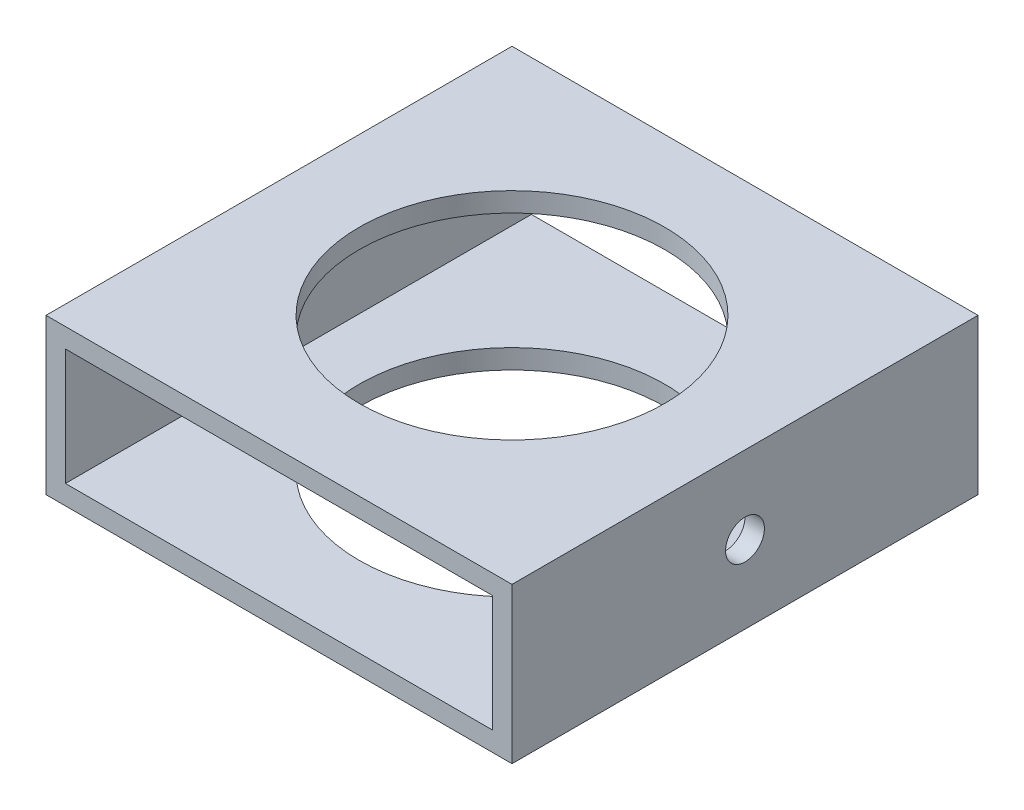
ISO-10303-21;
HEADER;
FILE_DESCRIPTION(('STEP AP214'),'2;1');
FILE_NAME('part.step','',(''),(''),'','','');
FILE_SCHEMA(('AUTOMOTIVE_DESIGN { 1 0 10303 214 1 1 1 1 }'));
ENDSEC;
DATA;
#1=APPLICATION_CONTEXT('core data for automotive mechanical design processes');
#2=APPLICATION_PROTOCOL_DEFINITION('international standard','automotive_design',2000,#1);
#3=PRODUCT_CONTEXT('',#1,'mechanical');
#4=PRODUCT('Part','Part','',(#3));
#5=PRODUCT_RELATED_PRODUCT_CATEGORY('part','',(#4));
#6=PRODUCT_DEFINITION_FORMATION('','',#4);
#7=PRODUCT_DEFINITION_CONTEXT('part definition',#1,'design');
#8=PRODUCT_DEFINITION('design','',#6,#7);
#9=PRODUCT_DEFINITION_SHAPE('','',#8);
#10=(LENGTH_UNIT() NAMED_UNIT(*) SI_UNIT(.MILLI.,.METRE.));
#11=(NAMED_UNIT(*) PLANE_ANGLE_UNIT() SI_UNIT($,.RADIAN.));
#12=(NAMED_UNIT(*) SI_UNIT($,.STERADIAN.) SOLID_ANGLE_UNIT());
#13=UNCERTAINTY_MEASURE_WITH_UNIT(LENGTH_MEASURE(1.E-05),#10,'distance_accuracy_value','');
#14=(GEOMETRIC_REPRESENTATION_CONTEXT(3) GLOBAL_UNCERTAINTY_ASSIGNED_CONTEXT((#13)) GLOBAL_UNIT_ASSIGNED_CONTEXT((#10,
#11,#12)) REPRESENTATION_CONTEXT('',''));
#15=CARTESIAN_POINT('',(0.,0.,0.));
#16=DIRECTION('',(0.,0.,1.));
#17=DIRECTION('',(1.,0.,0.));
#18=AXIS2_PLACEMENT_3D('',#15,#16,#17);
#19=CARTESIAN_POINT('',(0.,0.,38.1));
#20=DIRECTION('',(0.,0.,1.));
#21=DIRECTION('',(1.,0.,0.));
#22=AXIS2_PLACEMENT_3D('',#19,#20,#21);
#23=PLANE('',#22);
#24=DIRECTION('',(0.,1.,0.));
#25=VECTOR('',#24,1.);
#26=CARTESIAN_POINT('',(38.1,-12.7,38.1));
#27=LINE('',#26,#25);
#28=CARTESIAN_POINT('',(38.1,-12.7,38.1));
#29=VERTEX_POINT('',#28);
#30=CARTESIAN_POINT('',(38.1,12.7,38.1));
#31=VERTEX_POINT('',#30);
#32=EDGE_CURVE('E179',#29,#31,#27,.T.);
#33=ORIENTED_EDGE('',*,*,#32,.T.);
#34=DIRECTION('',(-1.,0.,0.));
#35=VECTOR('',#34,1.);
#36=CARTESIAN_POINT('',(-38.1,12.7,38.1));
#37=LINE('',#36,#35);
#38=CARTESIAN_POINT('',(-38.1,12.7,38.1));
#39=VERTEX_POINT('',#38);
#40=EDGE_CURVE('E183',#31,#39,#37,.T.);
#41=ORIENTED_EDGE('',*,*,#40,.T.);
#42=DIRECTION('',(0.,-1.,0.));
#43=VECTOR('',#42,1.);
#44=CARTESIAN_POINT('',(-38.1,-12.7,38.1));
#45=LINE('',#44,#43);
#46=CARTESIAN_POINT('',(-38.1,-12.7,38.1));
#47=VERTEX_POINT('',#46);
#48=EDGE_CURVE('E187',#39,#47,#45,.T.);
#49=ORIENTED_EDGE('',*,*,#48,.T.);
#50=DIRECTION('',(1.,0.,0.));
#51=VECTOR('',#50,1.);
#52=CARTESIAN_POINT('',(-38.1,-12.7,38.1));
#53=LINE('',#52,#51);
#54=EDGE_CURVE('E190',#47,#29,#53,.T.);
#55=ORIENTED_EDGE('',*,*,#54,.T.);
#56=EDGE_LOOP('',(#33,#41,#49,#55));
#57=FACE_BOUND('',#56,.T.);
#58=DIRECTION('',(-1.,0.,0.));
#59=VECTOR('',#58,1.);
#60=CARTESIAN_POINT('',(0.,9.525,38.1));
#61=LINE('',#60,#59);
#62=CARTESIAN_POINT('',(34.925,9.525,38.1));
#63=VERTEX_POINT('',#62);
#64=CARTESIAN_POINT('',(-34.925,9.525,38.1));
#65=VERTEX_POINT('',#64);
#66=EDGE_CURVE('E138',#63,#65,#61,.T.);
#67=ORIENTED_EDGE('',*,*,#66,.F.);
#68=DIRECTION('',(0.,1.,0.));
#69=VECTOR('',#68,1.);
#70=CARTESIAN_POINT('',(34.925,0.,38.1));
#71=LINE('',#70,#69);
#72=CARTESIAN_POINT('',(34.925,-9.525,38.1));
#73=VERTEX_POINT('',#72);
#74=EDGE_CURVE('E129',#73,#63,#71,.T.);
#75=ORIENTED_EDGE('',*,*,#74,.F.);
#76=DIRECTION('',(1.,0.,0.));
#77=VECTOR('',#76,1.);
#78=CARTESIAN_POINT('',(0.,-9.525,38.1));
#79=LINE('',#78,#77);
#80=CARTESIAN_POINT('',(-34.925,-9.525,38.1));
#81=VERTEX_POINT('',#80);
#82=EDGE_CURVE('E155',#81,#73,#79,.T.);
#83=ORIENTED_EDGE('',*,*,#82,.F.);
#84=DIRECTION('',(0.,-1.,0.));
#85=VECTOR('',#84,1.);
#86=CARTESIAN_POINT('',(-34.925,0.,38.1));
#87=LINE('',#86,#85);
#88=EDGE_CURVE('E151',#65,#81,#87,.T.);
#89=ORIENTED_EDGE('',*,*,#88,.F.);
#90=EDGE_LOOP('',(#67,#75,#83,#89));
#91=FACE_BOUND('',#90,.T.);
#92=ADVANCED_FACE('F61',(#57,#91),#23,.T.);
#93=CARTESIAN_POINT('',(0.,0.,-38.1));
#94=DIRECTION('',(0.,0.,1.));
#95=DIRECTION('',(1.,0.,0.));
#96=AXIS2_PLACEMENT_3D('',#93,#94,#95);
#97=PLANE('',#96);
#98=DIRECTION('',(0.,1.,0.));
#99=VECTOR('',#98,1.);
#100=CARTESIAN_POINT('',(38.1,-12.7,-38.1));
#101=LINE('',#100,#99);
#102=CARTESIAN_POINT('',(38.1,-12.7,-38.1));
#103=VERTEX_POINT('',#102);
#104=CARTESIAN_POINT('',(38.1,12.7,-38.1));
#105=VERTEX_POINT('',#104);
#106=EDGE_CURVE('E147',#103,#105,#101,.T.);
#107=ORIENTED_EDGE('',*,*,#106,.F.);
#108=DIRECTION('',(1.,0.,0.));
#109=VECTOR('',#108,1.);
#110=CARTESIAN_POINT('',(-38.1,-12.7,-38.1));
#111=LINE('',#110,#109);
#112=CARTESIAN_POINT('',(-38.1,-12.7,-38.1));
#113=VERTEX_POINT('',#112);
#114=EDGE_CURVE('E184',#113,#103,#111,.T.);
#115=ORIENTED_EDGE('',*,*,#114,.F.);
#116=DIRECTION('',(0.,-1.,0.));
#117=VECTOR('',#116,1.);
#118=CARTESIAN_POINT('',(-38.1,-12.7,-38.1));
#119=LINE('',#118,#117);
#120=CARTESIAN_POINT('',(-38.1,12.7,-38.1));
#121=VERTEX_POINT('',#120);
#122=EDGE_CURVE('E200',#121,#113,#119,.T.);
#123=ORIENTED_EDGE('',*,*,#122,.F.);
#124=DIRECTION('',(-1.,0.,0.));
#125=VECTOR('',#124,1.);
#126=CARTESIAN_POINT('',(-38.1,12.7,-38.1));
#127=LINE('',#126,#125);
#128=EDGE_CURVE('E197',#105,#121,#127,.T.);
#129=ORIENTED_EDGE('',*,*,#128,.F.);
#130=EDGE_LOOP('',(#107,#115,#123,#129));
#131=FACE_BOUND('',#130,.T.);
#132=DIRECTION('',(0.,1.,0.));
#133=VECTOR('',#132,1.);
#134=CARTESIAN_POINT('',(34.925,0.,-38.1));
#135=LINE('',#134,#133);
#136=CARTESIAN_POINT('',(34.925,-9.525,-38.1));
#137=VERTEX_POINT('',#136);
#138=CARTESIAN_POINT('',(34.925,9.525,-38.1));
#139=VERTEX_POINT('',#138);
#140=EDGE_CURVE('E87',#137,#139,#135,.T.);
#141=ORIENTED_EDGE('',*,*,#140,.T.);
#142=DIRECTION('',(-1.,0.,0.));
#143=VECTOR('',#142,1.);
#144=CARTESIAN_POINT('',(0.,9.525,-38.1));
#145=LINE('',#144,#143);
#146=CARTESIAN_POINT('',(-34.925,9.525,-38.1));
#147=VERTEX_POINT('',#146);
#148=EDGE_CURVE('E145',#139,#147,#145,.T.);
#149=ORIENTED_EDGE('',*,*,#148,.T.);
#150=DIRECTION('',(0.,-1.,0.));
#151=VECTOR('',#150,1.);
#152=CARTESIAN_POINT('',(-34.925,0.,-38.1));
#153=LINE('',#152,#151);
#154=CARTESIAN_POINT('',(-34.925,-9.525,-38.1));
#155=VERTEX_POINT('',#154);
#156=EDGE_CURVE('E166',#147,#155,#153,.T.);
#157=ORIENTED_EDGE('',*,*,#156,.T.);
#158=DIRECTION('',(1.,0.,0.));
#159=VECTOR('',#158,1.);
#160=CARTESIAN_POINT('',(0.,-9.525,-38.1));
#161=LINE('',#160,#159);
#162=EDGE_CURVE('E139',#155,#137,#161,.T.);
#163=ORIENTED_EDGE('',*,*,#162,.T.);
#164=EDGE_LOOP('',(#141,#149,#157,#163));
#165=FACE_BOUND('',#164,.T.);
#166=ADVANCED_FACE('F259',(#131,#165),#97,.F.);
#167=CARTESIAN_POINT('',(38.1,-12.7,38.1));
#168=DIRECTION('',(-1.,0.,0.));
#169=DIRECTION('',(0.,0.,1.));
#170=AXIS2_PLACEMENT_3D('',#167,#168,#169);
#171=PLANE('',#170);
#172=CARTESIAN_POINT('',(38.1,0.,0.));
#173=DIRECTION('',(-1.,0.,0.));
#174=DIRECTION('',(0.,0.,1.));
#175=AXIS2_PLACEMENT_3D('',#172,#173,#174);
#176=CIRCLE('',#175,3.175);
#177=CARTESIAN_POINT('',(38.1,0.,3.175));
#178=VERTEX_POINT('',#177);
#179=EDGE_CURVE('E217',#178,#178,#176,.T.);
#180=ORIENTED_EDGE('',*,*,#179,.T.);
#181=EDGE_LOOP('',(#180));
#182=FACE_BOUND('',#181,.T.);
#183=ORIENTED_EDGE('',*,*,#106,.T.);
#184=DIRECTION('',(0.,0.,-1.));
#185=VECTOR('',#184,1.);
#186=CARTESIAN_POINT('',(38.1,12.7,38.1));
#187=LINE('',#186,#185);
#188=EDGE_CURVE('E12',#31,#105,#187,.T.);
#189=ORIENTED_EDGE('',*,*,#188,.F.);
#190=ORIENTED_EDGE('',*,*,#32,.F.);
#191=DIRECTION('',(0.,0.,-1.));
#192=VECTOR('',#191,1.);
#193=CARTESIAN_POINT('',(38.1,-12.7,38.1));
#194=LINE('',#193,#192);
#195=EDGE_CURVE('E193',#29,#103,#194,.T.);
#196=ORIENTED_EDGE('',*,*,#195,.T.);
#197=EDGE_LOOP('',(#183,#189,#190,#196));
#198=FACE_BOUND('',#197,.T.);
#199=ADVANCED_FACE('F63',(#182,#198),#171,.F.);
#200=CARTESIAN_POINT('',(-38.1,12.7,38.1));
#201=DIRECTION('',(0.,-1.,0.));
#202=DIRECTION('',(0.,0.,-1.));
#203=AXIS2_PLACEMENT_3D('',#200,#201,#202);
#204=PLANE('',#203);
#205=CARTESIAN_POINT('',(0.,12.7,0.));
#206=DIRECTION('',(0.,1.,0.));
#207=DIRECTION('',(0.,0.,1.));
#208=AXIS2_PLACEMENT_3D('',#205,#206,#207);
#209=CIRCLE('',#208,24.97201);
#210=CARTESIAN_POINT('',(0.,12.7,24.97201));
#211=VERTEX_POINT('',#210);
#212=EDGE_CURVE('E236',#211,#211,#209,.T.);
#213=ORIENTED_EDGE('',*,*,#212,.F.);
#214=EDGE_LOOP('',(#213));
#215=FACE_BOUND('',#214,.T.);
#216=ORIENTED_EDGE('',*,*,#128,.T.);
#217=DIRECTION('',(0.,0.,-1.));
#218=VECTOR('',#217,1.);
#219=CARTESIAN_POINT('',(-38.1,12.7,38.1));
#220=LINE('',#219,#218);
#221=EDGE_CURVE('E71',#39,#121,#220,.T.);
#222=ORIENTED_EDGE('',*,*,#221,.F.);
#223=ORIENTED_EDGE('',*,*,#40,.F.);
#224=ORIENTED_EDGE('',*,*,#188,.T.);
#225=EDGE_LOOP('',(#216,#222,#223,#224));
#226=FACE_BOUND('',#225,.T.);
#227=ADVANCED_FACE('F284',(#215,#226),#204,.F.);
#228=CARTESIAN_POINT('',(-38.1,-12.7,38.1));
#229=DIRECTION('',(1.,0.,0.));
#230=DIRECTION('',(0.,0.,-1.));
#231=AXIS2_PLACEMENT_3D('',#228,#229,#230);
#232=PLANE('',#231);
#233=CARTESIAN_POINT('',(-38.1,0.,0.));
#234=DIRECTION('',(-1.,0.,0.));
#235=DIRECTION('',(0.,0.,1.));
#236=AXIS2_PLACEMENT_3D('',#233,#234,#235);
#237=CIRCLE('',#236,3.175);
#238=CARTESIAN_POINT('',(-38.1,0.,3.175));
#239=VERTEX_POINT('',#238);
#240=EDGE_CURVE('E224',#239,#239,#237,.T.);
#241=ORIENTED_EDGE('',*,*,#240,.F.);
#242=EDGE_LOOP('',(#241));
#243=FACE_BOUND('',#242,.T.);
#244=ORIENTED_EDGE('',*,*,#122,.T.);
#245=DIRECTION('',(0.,0.,-1.));
#246=VECTOR('',#245,1.);
#247=CARTESIAN_POINT('',(-38.1,-12.7,38.1));
#248=LINE('',#247,#246);
#249=EDGE_CURVE('E208',#47,#113,#248,.T.);
#250=ORIENTED_EDGE('',*,*,#249,.F.);
#251=ORIENTED_EDGE('',*,*,#48,.F.);
#252=ORIENTED_EDGE('',*,*,#221,.T.);
#253=EDGE_LOOP('',(#244,#250,#251,#252));
#254=FACE_BOUND('',#253,.T.);
#255=ADVANCED_FACE('F282',(#243,#254),#232,.F.);
#256=CARTESIAN_POINT('',(-38.1,-12.7,38.1));
#257=DIRECTION('',(0.,1.,0.));
#258=DIRECTION('',(0.,0.,1.));
#259=AXIS2_PLACEMENT_3D('',#256,#257,#258);
#260=PLANE('',#259);
#261=CARTESIAN_POINT('',(0.,-12.7,0.));
#262=DIRECTION('',(0.,1.,0.));
#263=DIRECTION('',(0.,0.,1.));
#264=AXIS2_PLACEMENT_3D('',#261,#262,#263);
#265=CIRCLE('',#264,24.97201);
#266=CARTESIAN_POINT('',(0.,-12.7,24.97201));
#267=VERTEX_POINT('',#266);
#268=EDGE_CURVE('E240',#267,#267,#265,.T.);
#269=ORIENTED_EDGE('',*,*,#268,.T.);
#270=EDGE_LOOP('',(#269));
#271=FACE_BOUND('',#270,.T.);
#272=ORIENTED_EDGE('',*,*,#114,.T.);
#273=ORIENTED_EDGE('',*,*,#195,.F.);
#274=ORIENTED_EDGE('',*,*,#54,.F.);
#275=ORIENTED_EDGE('',*,*,#249,.T.);
#276=EDGE_LOOP('',(#272,#273,#274,#275));
#277=FACE_BOUND('',#276,.T.);
#278=ADVANCED_FACE('F279',(#271,#277),#260,.F.);
#279=CARTESIAN_POINT('',(34.925,0.,38.1));
#280=DIRECTION('',(-1.,0.,0.));
#281=DIRECTION('',(0.,0.,1.));
#282=AXIS2_PLACEMENT_3D('',#279,#280,#281);
#283=PLANE('',#282);
#284=CARTESIAN_POINT('',(34.925,0.,0.));
#285=DIRECTION('',(-1.,0.,0.));
#286=DIRECTION('',(0.,0.,1.));
#287=AXIS2_PLACEMENT_3D('',#284,#285,#286);
#288=CIRCLE('',#287,3.175);
#289=CARTESIAN_POINT('',(34.925,0.,3.175));
#290=VERTEX_POINT('',#289);
#291=EDGE_CURVE('E163',#290,#290,#288,.T.);
#292=ORIENTED_EDGE('',*,*,#291,.F.);
#293=EDGE_LOOP('',(#292));
#294=FACE_BOUND('',#293,.T.);
#295=ORIENTED_EDGE('',*,*,#140,.F.);
#296=DIRECTION('',(0.,0.,-1.));
#297=VECTOR('',#296,1.);
#298=CARTESIAN_POINT('',(34.925,-9.525,38.1));
#299=LINE('',#298,#297);
#300=EDGE_CURVE('E133',#73,#137,#299,.T.);
#301=ORIENTED_EDGE('',*,*,#300,.F.);
#302=ORIENTED_EDGE('',*,*,#74,.T.);
#303=DIRECTION('',(0.,0.,-1.));
#304=VECTOR('',#303,1.);
#305=CARTESIAN_POINT('',(34.925,9.525,38.1));
#306=LINE('',#305,#304);
#307=EDGE_CURVE('E132',#63,#139,#306,.T.);
#308=ORIENTED_EDGE('',*,*,#307,.T.);
#309=EDGE_LOOP('',(#295,#301,#302,#308));
#310=FACE_BOUND('',#309,.T.);
#311=ADVANCED_FACE('F131',(#294,#310),#283,.T.);
#312=CARTESIAN_POINT('',(0.,9.525,38.1));
#313=DIRECTION('',(0.,-1.,0.));
#314=DIRECTION('',(0.,0.,-1.));
#315=AXIS2_PLACEMENT_3D('',#312,#313,#314);
#316=PLANE('',#315);
#317=CARTESIAN_POINT('',(0.,9.525,0.));
#318=DIRECTION('',(0.,-1.,0.));
#319=DIRECTION('',(0.,0.,-1.));
#320=AXIS2_PLACEMENT_3D('',#317,#318,#319);
#321=CIRCLE('',#320,24.97201);
#322=CARTESIAN_POINT('',(0.,9.525,-24.97201));
#323=VERTEX_POINT('',#322);
#324=EDGE_CURVE('E230',#323,#323,#321,.T.);
#325=ORIENTED_EDGE('',*,*,#324,.F.);
#326=EDGE_LOOP('',(#325));
#327=FACE_BOUND('',#326,.T.);
#328=ORIENTED_EDGE('',*,*,#148,.F.);
#329=ORIENTED_EDGE('',*,*,#307,.F.);
#330=ORIENTED_EDGE('',*,*,#66,.T.);
#331=DIRECTION('',(0.,0.,-1.));
#332=VECTOR('',#331,1.);
#333=CARTESIAN_POINT('',(-34.925,9.525,38.1));
#334=LINE('',#333,#332);
#335=EDGE_CURVE('E148',#65,#147,#334,.T.);
#336=ORIENTED_EDGE('',*,*,#335,.T.);
#337=EDGE_LOOP('',(#328,#329,#330,#336));
#338=FACE_BOUND('',#337,.T.);
#339=ADVANCED_FACE('F142',(#327,#338),#316,.T.);
#340=CARTESIAN_POINT('',(-34.925,0.,38.1));
#341=DIRECTION('',(1.,0.,0.));
#342=DIRECTION('',(0.,0.,-1.));
#343=AXIS2_PLACEMENT_3D('',#340,#341,#342);
#344=PLANE('',#343);
#345=CARTESIAN_POINT('',(-34.925,0.,0.));
#346=DIRECTION('',(1.,0.,0.));
#347=DIRECTION('',(0.,0.,-1.));
#348=AXIS2_PLACEMENT_3D('',#345,#346,#347);
#349=CIRCLE('',#348,3.175);
#350=CARTESIAN_POINT('',(-34.925,0.,-3.175));
#351=VERTEX_POINT('',#350);
#352=EDGE_CURVE('E214',#351,#351,#349,.T.);
#353=ORIENTED_EDGE('',*,*,#352,.F.);
#354=EDGE_LOOP('',(#353));
#355=FACE_BOUND('',#354,.T.);
#356=ORIENTED_EDGE('',*,*,#156,.F.);
#357=ORIENTED_EDGE('',*,*,#335,.F.);
#358=ORIENTED_EDGE('',*,*,#88,.T.);
#359=DIRECTION('',(0.,0.,-1.));
#360=VECTOR('',#359,1.);
#361=CARTESIAN_POINT('',(-34.925,-9.525,38.1));
#362=LINE('',#361,#360);
#363=EDGE_CURVE('E79',#81,#155,#362,.T.);
#364=ORIENTED_EDGE('',*,*,#363,.T.);
#365=EDGE_LOOP('',(#356,#357,#358,#364));
#366=FACE_BOUND('',#365,.T.);
#367=ADVANCED_FACE('F255',(#355,#366),#344,.T.);
#368=CARTESIAN_POINT('',(0.,-9.525,38.1));
#369=DIRECTION('',(0.,1.,0.));
#370=DIRECTION('',(0.,0.,1.));
#371=AXIS2_PLACEMENT_3D('',#368,#369,#370);
#372=PLANE('',#371);
#373=CARTESIAN_POINT('',(0.,-9.525,0.));
#374=DIRECTION('',(0.,1.,0.));
#375=DIRECTION('',(0.,0.,1.));
#376=AXIS2_PLACEMENT_3D('',#373,#374,#375);
#377=CIRCLE('',#376,24.97201);
#378=CARTESIAN_POINT('',(0.,-9.525,24.97201));
#379=VERTEX_POINT('',#378);
#380=EDGE_CURVE('E65',#379,#379,#377,.T.);
#381=ORIENTED_EDGE('',*,*,#380,.F.);
#382=EDGE_LOOP('',(#381));
#383=FACE_BOUND('',#382,.T.);
#384=ORIENTED_EDGE('',*,*,#162,.F.);
#385=ORIENTED_EDGE('',*,*,#363,.F.);
#386=ORIENTED_EDGE('',*,*,#82,.T.);
#387=ORIENTED_EDGE('',*,*,#300,.T.);
#388=EDGE_LOOP('',(#384,#385,#386,#387));
#389=FACE_BOUND('',#388,.T.);
#390=ADVANCED_FACE('F252',(#383,#389),#372,.T.);
#391=CARTESIAN_POINT('',(38.1,0.,0.));
#392=DIRECTION('',(-1.,0.,0.));
#393=DIRECTION('',(0.,0.,1.));
#394=AXIS2_PLACEMENT_3D('',#391,#392,#393);
#395=CYLINDRICAL_SURFACE('',#394,3.175);
#396=ORIENTED_EDGE('',*,*,#352,.T.);
#397=EDGE_LOOP('',(#396));
#398=FACE_BOUND('',#397,.T.);
#399=ORIENTED_EDGE('',*,*,#240,.T.);
#400=EDGE_LOOP('',(#399));
#401=FACE_BOUND('',#400,.T.);
#402=ADVANCED_FACE('F254',(#398,#401),#395,.F.);
#403=ORIENTED_EDGE('',*,*,#291,.T.);
#404=EDGE_LOOP('',(#403));
#405=FACE_BOUND('',#404,.T.);
#406=ORIENTED_EDGE('',*,*,#179,.F.);
#407=EDGE_LOOP('',(#406));
#408=FACE_BOUND('',#407,.T.);
#409=ADVANCED_FACE('F314',(#405,#408),#395,.F.);
#410=CARTESIAN_POINT('',(0.,-12.7,0.));
#411=DIRECTION('',(0.,1.,0.));
#412=DIRECTION('',(0.,0.,1.));
#413=AXIS2_PLACEMENT_3D('',#410,#411,#412);
#414=CYLINDRICAL_SURFACE('',#413,24.97201);
#415=ORIENTED_EDGE('',*,*,#380,.T.);
#416=EDGE_LOOP('',(#415));
#417=FACE_BOUND('',#416,.T.);
#418=ORIENTED_EDGE('',*,*,#268,.F.);
#419=EDGE_LOOP('',(#418));
#420=FACE_BOUND('',#419,.T.);
#421=ADVANCED_FACE('F249',(#417,#420),#414,.F.);
#422=ORIENTED_EDGE('',*,*,#324,.T.);
#423=EDGE_LOOP('',(#422));
#424=FACE_BOUND('',#423,.T.);
#425=ORIENTED_EDGE('',*,*,#212,.T.);
#426=EDGE_LOOP('',(#425));
#427=FACE_BOUND('',#426,.T.);
#428=ADVANCED_FACE('F307',(#424,#427),#414,.F.);
#429=CLOSED_SHELL('',(#92,#166,#199,#227,#255,#278,#311,#339,#367,#390,#402,#409,#421,#428));
#430=MANIFOLD_SOLID_BREP('B2',#429);
#431=ADVANCED_BREP_SHAPE_REPRESENTATION('',(#18,#430),#14);
#432=SHAPE_DEFINITION_REPRESENTATION(#9,#431);
ENDSEC;
END-ISO-10303-21;
